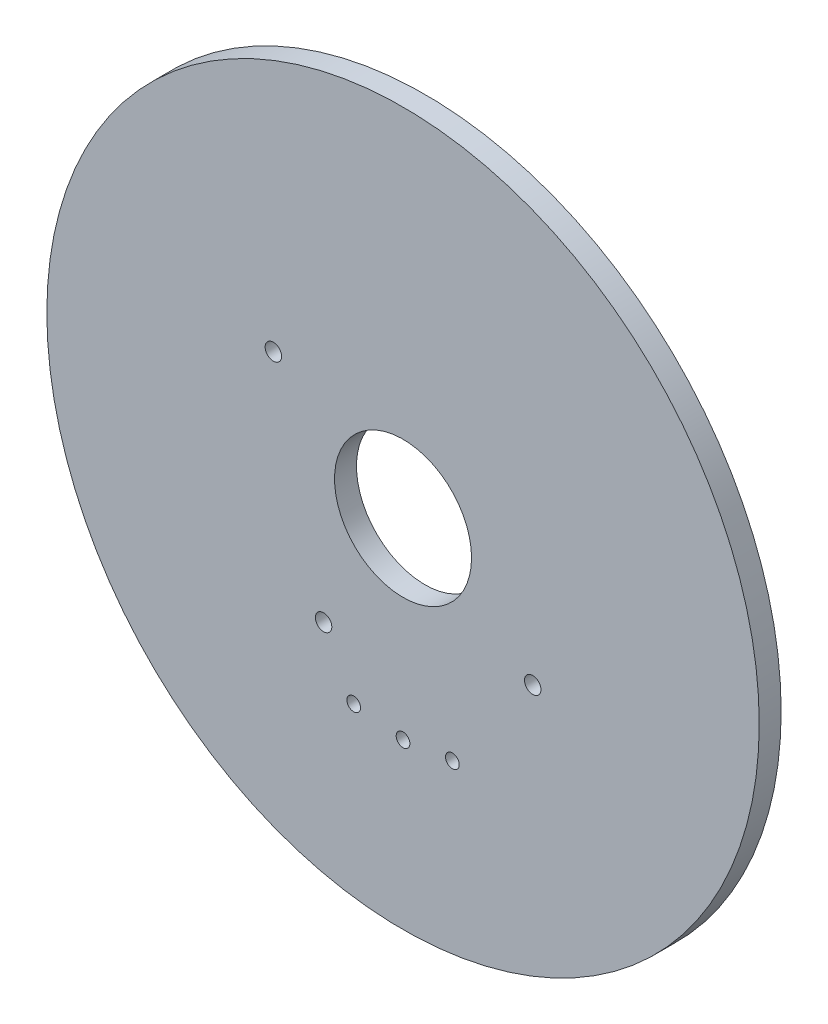
ISO-10303-21;
HEADER;
FILE_DESCRIPTION(('STEP AP214'),'2;1');
FILE_NAME('part.step','',(''),(''),'','','');
FILE_SCHEMA(('AUTOMOTIVE_DESIGN { 1 0 10303 214 1 1 1 1 }'));
ENDSEC;
DATA;
#1=APPLICATION_CONTEXT('core data for automotive mechanical design processes');
#2=APPLICATION_PROTOCOL_DEFINITION('international standard','automotive_design',2000,#1);
#3=PRODUCT_CONTEXT('',#1,'mechanical');
#4=PRODUCT('Part','Part','',(#3));
#5=PRODUCT_RELATED_PRODUCT_CATEGORY('part','',(#4));
#6=PRODUCT_DEFINITION_FORMATION('','',#4);
#7=PRODUCT_DEFINITION_CONTEXT('part definition',#1,'design');
#8=PRODUCT_DEFINITION('design','',#6,#7);
#9=PRODUCT_DEFINITION_SHAPE('','',#8);
#10=(LENGTH_UNIT() NAMED_UNIT(*) SI_UNIT(.MILLI.,.METRE.));
#11=(NAMED_UNIT(*) PLANE_ANGLE_UNIT() SI_UNIT($,.RADIAN.));
#12=(NAMED_UNIT(*) SI_UNIT($,.STERADIAN.) SOLID_ANGLE_UNIT());
#13=UNCERTAINTY_MEASURE_WITH_UNIT(LENGTH_MEASURE(1.E-05),#10,'distance_accuracy_value','');
#14=(GEOMETRIC_REPRESENTATION_CONTEXT(3) GLOBAL_UNCERTAINTY_ASSIGNED_CONTEXT((#13)) GLOBAL_UNIT_ASSIGNED_CONTEXT((#10,
#11,#12)) REPRESENTATION_CONTEXT('',''));
#15=CARTESIAN_POINT('',(0.,0.,0.));
#16=DIRECTION('',(0.,0.,1.));
#17=DIRECTION('',(1.,0.,0.));
#18=AXIS2_PLACEMENT_3D('',#15,#16,#17);
#19=CARTESIAN_POINT('',(0.,0.,0.8));
#20=DIRECTION('',(0.,0.,1.));
#21=DIRECTION('',(1.,0.,0.));
#22=AXIS2_PLACEMENT_3D('',#19,#20,#21);
#23=PLANE('',#22);
#24=CARTESIAN_POINT('',(-4.73299587998975,2.90000000000016,0.8));
#25=DIRECTION('',(0.,0.,1.));
#26=DIRECTION('',(1.,0.,0.));
#27=AXIS2_PLACEMENT_3D('',#24,#25,#26);
#28=CIRCLE('',#27,0.299999999999909);
#29=CARTESIAN_POINT('',(-4.43299587998985,2.90000000000016,0.8));
#30=VERTEX_POINT('',#29);
#31=EDGE_CURVE('E79',#30,#30,#28,.T.);
#32=ORIENTED_EDGE('',*,*,#31,.F.);
#33=EDGE_LOOP('',(#32));
#34=FACE_BOUND('',#33,.T.);
#35=CARTESIAN_POINT('',(-2.90000000000016,-4.73299587998975,0.8));
#36=DIRECTION('',(0.,0.,1.));
#37=DIRECTION('',(1.,0.,0.));
#38=AXIS2_PLACEMENT_3D('',#35,#36,#37);
#39=CIRCLE('',#38,0.300000000000102);
#40=CARTESIAN_POINT('',(-2.60000000000005,-4.73299587998975,0.8));
#41=VERTEX_POINT('',#40);
#42=EDGE_CURVE('E82',#41,#41,#39,.T.);
#43=ORIENTED_EDGE('',*,*,#42,.F.);
#44=EDGE_LOOP('',(#43));
#45=FACE_BOUND('',#44,.T.);
#46=CARTESIAN_POINT('',(4.73299587998975,-2.90000000000016,0.8));
#47=DIRECTION('',(0.,0.,1.));
#48=DIRECTION('',(1.,0.,0.));
#49=AXIS2_PLACEMENT_3D('',#46,#47,#48);
#50=CIRCLE('',#49,0.3);
#51=CARTESIAN_POINT('',(5.03299587998975,-2.90000000000016,0.8));
#52=VERTEX_POINT('',#51);
#53=EDGE_CURVE('E85',#52,#52,#50,.T.);
#54=ORIENTED_EDGE('',*,*,#53,.F.);
#55=EDGE_LOOP('',(#54));
#56=FACE_BOUND('',#55,.T.);
#57=CARTESIAN_POINT('',(1.8,-6.76461381011511,0.8));
#58=DIRECTION('',(0.,0.,1.));
#59=DIRECTION('',(1.,0.,0.));
#60=AXIS2_PLACEMENT_3D('',#57,#58,#59);
#61=CIRCLE('',#60,0.25);
#62=CARTESIAN_POINT('',(2.05,-6.76461381011511,0.8));
#63=VERTEX_POINT('',#62);
#64=EDGE_CURVE('E88',#63,#63,#61,.T.);
#65=ORIENTED_EDGE('',*,*,#64,.F.);
#66=EDGE_LOOP('',(#65));
#67=FACE_BOUND('',#66,.T.);
#68=CARTESIAN_POINT('',(-1.8,-6.76461381011511,0.8));
#69=DIRECTION('',(0.,0.,1.));
#70=DIRECTION('',(1.,0.,0.));
#71=AXIS2_PLACEMENT_3D('',#68,#69,#70);
#72=CIRCLE('',#71,0.25);
#73=CARTESIAN_POINT('',(-1.55,-6.76461381011511,0.8));
#74=VERTEX_POINT('',#73);
#75=EDGE_CURVE('E78',#74,#74,#72,.T.);
#76=ORIENTED_EDGE('',*,*,#75,.F.);
#77=EDGE_LOOP('',(#76));
#78=FACE_BOUND('',#77,.T.);
#79=CARTESIAN_POINT('',(0.,-7.,0.8));
#80=DIRECTION('',(0.,0.,1.));
#81=DIRECTION('',(1.,0.,0.));
#82=AXIS2_PLACEMENT_3D('',#79,#80,#81);
#83=CIRCLE('',#82,0.25);
#84=CARTESIAN_POINT('',(0.25,-7.,0.8));
#85=VERTEX_POINT('',#84);
#86=EDGE_CURVE('E54',#85,#85,#83,.T.);
#87=ORIENTED_EDGE('',*,*,#86,.F.);
#88=EDGE_LOOP('',(#87));
#89=FACE_BOUND('',#88,.T.);
#90=CARTESIAN_POINT('',(0.,0.,0.8));
#91=DIRECTION('',(0.,0.,1.));
#92=DIRECTION('',(1.,0.,0.));
#93=AXIS2_PLACEMENT_3D('',#90,#91,#92);
#94=CIRCLE('',#93,13.);
#95=CARTESIAN_POINT('',(13.,0.,0.8));
#96=VERTEX_POINT('',#95);
#97=EDGE_CURVE('E10',#96,#96,#94,.T.);
#98=ORIENTED_EDGE('',*,*,#97,.T.);
#99=EDGE_LOOP('',(#98));
#100=FACE_BOUND('',#99,.T.);
#101=CARTESIAN_POINT('',(0.,0.,0.8));
#102=DIRECTION('',(0.,0.,1.));
#103=DIRECTION('',(1.,0.,0.));
#104=AXIS2_PLACEMENT_3D('',#101,#102,#103);
#105=CIRCLE('',#104,2.5);
#106=CARTESIAN_POINT('',(2.5,0.,0.8));
#107=VERTEX_POINT('',#106);
#108=EDGE_CURVE('E44',#107,#107,#105,.T.);
#109=ORIENTED_EDGE('',*,*,#108,.F.);
#110=EDGE_LOOP('',(#109));
#111=FACE_BOUND('',#110,.T.);
#112=ADVANCED_FACE('F31',(#34,#45,#56,#67,#78,#89,#100,#111),#23,.T.);
#113=CARTESIAN_POINT('',(0.,0.,0.));
#114=DIRECTION('',(0.,0.,1.));
#115=DIRECTION('',(1.,0.,0.));
#116=AXIS2_PLACEMENT_3D('',#113,#114,#115);
#117=PLANE('',#116);
#118=CARTESIAN_POINT('',(-4.73299587998975,2.90000000000016,0.));
#119=DIRECTION('',(0.,0.,1.));
#120=DIRECTION('',(1.,0.,0.));
#121=AXIS2_PLACEMENT_3D('',#118,#119,#120);
#122=CIRCLE('',#121,0.299999999999909);
#123=CARTESIAN_POINT('',(-4.43299587998985,2.90000000000016,0.));
#124=VERTEX_POINT('',#123);
#125=EDGE_CURVE('E35',#124,#124,#122,.T.);
#126=ORIENTED_EDGE('',*,*,#125,.T.);
#127=EDGE_LOOP('',(#126));
#128=FACE_BOUND('',#127,.T.);
#129=CARTESIAN_POINT('',(-2.90000000000016,-4.73299587998975,0.));
#130=DIRECTION('',(0.,0.,1.));
#131=DIRECTION('',(1.,0.,0.));
#132=AXIS2_PLACEMENT_3D('',#129,#130,#131);
#133=CIRCLE('',#132,0.300000000000102);
#134=CARTESIAN_POINT('',(-2.60000000000005,-4.73299587998975,0.));
#135=VERTEX_POINT('',#134);
#136=EDGE_CURVE('E62',#135,#135,#133,.T.);
#137=ORIENTED_EDGE('',*,*,#136,.T.);
#138=EDGE_LOOP('',(#137));
#139=FACE_BOUND('',#138,.T.);
#140=CARTESIAN_POINT('',(4.73299587998975,-2.90000000000016,0.));
#141=DIRECTION('',(0.,0.,1.));
#142=DIRECTION('',(1.,0.,0.));
#143=AXIS2_PLACEMENT_3D('',#140,#141,#142);
#144=CIRCLE('',#143,0.3);
#145=CARTESIAN_POINT('',(5.03299587998975,-2.90000000000016,0.));
#146=VERTEX_POINT('',#145);
#147=EDGE_CURVE('E60',#146,#146,#144,.T.);
#148=ORIENTED_EDGE('',*,*,#147,.T.);
#149=EDGE_LOOP('',(#148));
#150=FACE_BOUND('',#149,.T.);
#151=CARTESIAN_POINT('',(1.8,-6.76461381011511,0.));
#152=DIRECTION('',(0.,0.,1.));
#153=DIRECTION('',(1.,0.,0.));
#154=AXIS2_PLACEMENT_3D('',#151,#152,#153);
#155=CIRCLE('',#154,0.25);
#156=CARTESIAN_POINT('',(2.05,-6.76461381011511,0.));
#157=VERTEX_POINT('',#156);
#158=EDGE_CURVE('E57',#157,#157,#155,.T.);
#159=ORIENTED_EDGE('',*,*,#158,.T.);
#160=EDGE_LOOP('',(#159));
#161=FACE_BOUND('',#160,.T.);
#162=CARTESIAN_POINT('',(-1.8,-6.76461381011511,0.));
#163=DIRECTION('',(0.,0.,1.));
#164=DIRECTION('',(1.,0.,0.));
#165=AXIS2_PLACEMENT_3D('',#162,#163,#164);
#166=CIRCLE('',#165,0.25);
#167=CARTESIAN_POINT('',(-1.55,-6.76461381011511,0.));
#168=VERTEX_POINT('',#167);
#169=EDGE_CURVE('E53',#168,#168,#166,.T.);
#170=ORIENTED_EDGE('',*,*,#169,.T.);
#171=EDGE_LOOP('',(#170));
#172=FACE_BOUND('',#171,.T.);
#173=CARTESIAN_POINT('',(0.,-7.,0.));
#174=DIRECTION('',(0.,0.,1.));
#175=DIRECTION('',(1.,0.,0.));
#176=AXIS2_PLACEMENT_3D('',#173,#174,#175);
#177=CIRCLE('',#176,0.25);
#178=CARTESIAN_POINT('',(0.25,-7.,0.));
#179=VERTEX_POINT('',#178);
#180=EDGE_CURVE('E50',#179,#179,#177,.T.);
#181=ORIENTED_EDGE('',*,*,#180,.T.);
#182=EDGE_LOOP('',(#181));
#183=FACE_BOUND('',#182,.T.);
#184=CARTESIAN_POINT('',(0.,0.,0.));
#185=DIRECTION('',(0.,0.,1.));
#186=DIRECTION('',(1.,0.,0.));
#187=AXIS2_PLACEMENT_3D('',#184,#185,#186);
#188=CIRCLE('',#187,13.);
#189=CARTESIAN_POINT('',(13.,0.,0.));
#190=VERTEX_POINT('',#189);
#191=EDGE_CURVE('E39',#190,#190,#188,.T.);
#192=ORIENTED_EDGE('',*,*,#191,.F.);
#193=EDGE_LOOP('',(#192));
#194=FACE_BOUND('',#193,.T.);
#195=CARTESIAN_POINT('',(0.,0.,0.));
#196=DIRECTION('',(0.,0.,1.));
#197=DIRECTION('',(1.,0.,0.));
#198=AXIS2_PLACEMENT_3D('',#195,#196,#197);
#199=CIRCLE('',#198,2.5);
#200=CARTESIAN_POINT('',(2.5,0.,0.));
#201=VERTEX_POINT('',#200);
#202=EDGE_CURVE('E47',#201,#201,#199,.T.);
#203=ORIENTED_EDGE('',*,*,#202,.T.);
#204=EDGE_LOOP('',(#203));
#205=FACE_BOUND('',#204,.T.);
#206=ADVANCED_FACE('F99',(#128,#139,#150,#161,#172,#183,#194,#205),#117,.F.);
#207=CARTESIAN_POINT('',(0.,0.,0.8));
#208=DIRECTION('',(0.,0.,-1.));
#209=DIRECTION('',(-1.,0.,0.));
#210=AXIS2_PLACEMENT_3D('',#207,#208,#209);
#211=CYLINDRICAL_SURFACE('',#210,13.);
#212=ORIENTED_EDGE('',*,*,#97,.F.);
#213=EDGE_LOOP('',(#212));
#214=FACE_BOUND('',#213,.T.);
#215=ORIENTED_EDGE('',*,*,#191,.T.);
#216=EDGE_LOOP('',(#215));
#217=FACE_BOUND('',#216,.T.);
#218=ADVANCED_FACE('F33',(#214,#217),#211,.T.);
#219=CARTESIAN_POINT('',(0.,0.,0.8));
#220=DIRECTION('',(0.,0.,-1.));
#221=DIRECTION('',(-1.,0.,0.));
#222=AXIS2_PLACEMENT_3D('',#219,#220,#221);
#223=CYLINDRICAL_SURFACE('',#222,2.5);
#224=ORIENTED_EDGE('',*,*,#108,.T.);
#225=EDGE_LOOP('',(#224));
#226=FACE_BOUND('',#225,.T.);
#227=ORIENTED_EDGE('',*,*,#202,.F.);
#228=EDGE_LOOP('',(#227));
#229=FACE_BOUND('',#228,.T.);
#230=ADVANCED_FACE('F108',(#226,#229),#223,.F.);
#231=CARTESIAN_POINT('',(0.,-7.,-0.8));
#232=DIRECTION('',(0.,0.,1.));
#233=DIRECTION('',(1.,0.,0.));
#234=AXIS2_PLACEMENT_3D('',#231,#232,#233);
#235=CYLINDRICAL_SURFACE('',#234,0.25);
#236=ORIENTED_EDGE('',*,*,#86,.T.);
#237=EDGE_LOOP('',(#236));
#238=FACE_BOUND('',#237,.T.);
#239=ORIENTED_EDGE('',*,*,#180,.F.);
#240=EDGE_LOOP('',(#239));
#241=FACE_BOUND('',#240,.T.);
#242=ADVANCED_FACE('F105',(#238,#241),#235,.F.);
#243=CARTESIAN_POINT('',(-1.8,-6.76461381011511,-0.8));
#244=DIRECTION('',(0.,0.,1.));
#245=DIRECTION('',(1.,0.,0.));
#246=AXIS2_PLACEMENT_3D('',#243,#244,#245);
#247=CYLINDRICAL_SURFACE('',#246,0.25);
#248=ORIENTED_EDGE('',*,*,#75,.T.);
#249=EDGE_LOOP('',(#248));
#250=FACE_BOUND('',#249,.T.);
#251=ORIENTED_EDGE('',*,*,#169,.F.);
#252=EDGE_LOOP('',(#251));
#253=FACE_BOUND('',#252,.T.);
#254=ADVANCED_FACE('F94',(#250,#253),#247,.F.);
#255=CARTESIAN_POINT('',(1.8,-6.76461381011511,-0.8));
#256=DIRECTION('',(0.,0.,1.));
#257=DIRECTION('',(1.,0.,0.));
#258=AXIS2_PLACEMENT_3D('',#255,#256,#257);
#259=CYLINDRICAL_SURFACE('',#258,0.25);
#260=ORIENTED_EDGE('',*,*,#64,.T.);
#261=EDGE_LOOP('',(#260));
#262=FACE_BOUND('',#261,.T.);
#263=ORIENTED_EDGE('',*,*,#158,.F.);
#264=EDGE_LOOP('',(#263));
#265=FACE_BOUND('',#264,.T.);
#266=ADVANCED_FACE('F137',(#262,#265),#259,.F.);
#267=CARTESIAN_POINT('',(4.73299587998975,-2.90000000000016,-0.8));
#268=DIRECTION('',(0.,0.,1.));
#269=DIRECTION('',(1.,0.,0.));
#270=AXIS2_PLACEMENT_3D('',#267,#268,#269);
#271=CYLINDRICAL_SURFACE('',#270,0.3);
#272=ORIENTED_EDGE('',*,*,#53,.T.);
#273=EDGE_LOOP('',(#272));
#274=FACE_BOUND('',#273,.T.);
#275=ORIENTED_EDGE('',*,*,#147,.F.);
#276=EDGE_LOOP('',(#275));
#277=FACE_BOUND('',#276,.T.);
#278=ADVANCED_FACE('F133',(#274,#277),#271,.F.);
#279=CARTESIAN_POINT('',(-2.90000000000016,-4.73299587998975,-0.8));
#280=DIRECTION('',(0.,0.,1.));
#281=DIRECTION('',(1.,0.,0.));
#282=AXIS2_PLACEMENT_3D('',#279,#280,#281);
#283=CYLINDRICAL_SURFACE('',#282,0.300000000000102);
#284=ORIENTED_EDGE('',*,*,#42,.T.);
#285=EDGE_LOOP('',(#284));
#286=FACE_BOUND('',#285,.T.);
#287=ORIENTED_EDGE('',*,*,#136,.F.);
#288=EDGE_LOOP('',(#287));
#289=FACE_BOUND('',#288,.T.);
#290=ADVANCED_FACE('F129',(#286,#289),#283,.F.);
#291=CARTESIAN_POINT('',(-4.73299587998975,2.90000000000016,-0.8));
#292=DIRECTION('',(0.,0.,1.));
#293=DIRECTION('',(1.,0.,0.));
#294=AXIS2_PLACEMENT_3D('',#291,#292,#293);
#295=CYLINDRICAL_SURFACE('',#294,0.299999999999909);
#296=ORIENTED_EDGE('',*,*,#31,.T.);
#297=EDGE_LOOP('',(#296));
#298=FACE_BOUND('',#297,.T.);
#299=ORIENTED_EDGE('',*,*,#125,.F.);
#300=EDGE_LOOP('',(#299));
#301=FACE_BOUND('',#300,.T.);
#302=ADVANCED_FACE('F126',(#298,#301),#295,.F.);
#303=CLOSED_SHELL('',(#112,#206,#218,#230,#242,#254,#266,#278,#290,#302));
#304=MANIFOLD_SOLID_BREP('B2',#303);
#305=ADVANCED_BREP_SHAPE_REPRESENTATION('',(#18,#304),#14);
#306=SHAPE_DEFINITION_REPRESENTATION(#9,#305);
ENDSEC;
END-ISO-10303-21;
